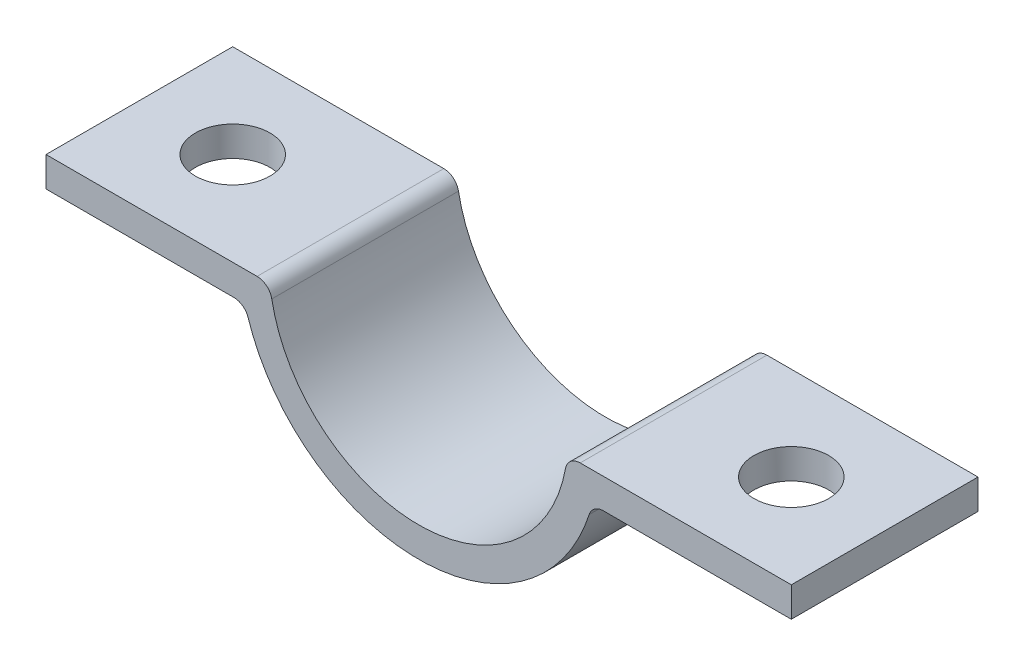
ISO-10303-21;
HEADER;
FILE_DESCRIPTION(('STEP AP214'),'2;1');
FILE_NAME('part.step','',(''),(''),'','','');
FILE_SCHEMA(('AUTOMOTIVE_DESIGN { 1 0 10303 214 1 1 1 1 }'));
ENDSEC;
DATA;
#1=APPLICATION_CONTEXT('core data for automotive mechanical design processes');
#2=APPLICATION_PROTOCOL_DEFINITION('international standard','automotive_design',2000,#1);
#3=PRODUCT_CONTEXT('',#1,'mechanical');
#4=PRODUCT('Part','Part','',(#3));
#5=PRODUCT_RELATED_PRODUCT_CATEGORY('part','',(#4));
#6=PRODUCT_DEFINITION_FORMATION('','',#4);
#7=PRODUCT_DEFINITION_CONTEXT('part definition',#1,'design');
#8=PRODUCT_DEFINITION('design','',#6,#7);
#9=PRODUCT_DEFINITION_SHAPE('','',#8);
#10=(LENGTH_UNIT() NAMED_UNIT(*) SI_UNIT(.MILLI.,.METRE.));
#11=(NAMED_UNIT(*) PLANE_ANGLE_UNIT() SI_UNIT($,.RADIAN.));
#12=(NAMED_UNIT(*) SI_UNIT($,.STERADIAN.) SOLID_ANGLE_UNIT());
#13=UNCERTAINTY_MEASURE_WITH_UNIT(LENGTH_MEASURE(1.E-05),#10,'distance_accuracy_value','');
#14=(GEOMETRIC_REPRESENTATION_CONTEXT(3) GLOBAL_UNCERTAINTY_ASSIGNED_CONTEXT((#13)) GLOBAL_UNIT_ASSIGNED_CONTEXT((#10,
#11,#12)) REPRESENTATION_CONTEXT('',''));
#15=CARTESIAN_POINT('',(0.,0.,0.));
#16=DIRECTION('',(0.,0.,1.));
#17=DIRECTION('',(1.,0.,0.));
#18=AXIS2_PLACEMENT_3D('',#15,#16,#17);
#19=CARTESIAN_POINT('',(24.9498743710662,19.0173195198486,12.5));
#20=DIRECTION('',(-1.,0.,0.));
#21=DIRECTION('',(0.,0.,1.));
#22=AXIS2_PLACEMENT_3D('',#19,#20,#21);
#23=PLANE('',#22);
#24=DIRECTION('',(0.,1.,0.));
#25=VECTOR('',#24,1.);
#26=CARTESIAN_POINT('',(24.9498743710662,19.0173195198486,0.));
#27=LINE('',#26,#25);
#28=CARTESIAN_POINT('',(24.9498743710662,17.0173195198486,0.));
#29=VERTEX_POINT('',#28);
#30=CARTESIAN_POINT('',(24.9498743710662,19.0173195198486,0.));
#31=VERTEX_POINT('',#30);
#32=EDGE_CURVE('E161',#29,#31,#27,.T.);
#33=ORIENTED_EDGE('',*,*,#32,.T.);
#34=DIRECTION('',(0.,0.,-1.));
#35=VECTOR('',#34,1.);
#36=CARTESIAN_POINT('',(24.9498743710662,19.0173195198486,12.5));
#37=LINE('',#36,#35);
#38=CARTESIAN_POINT('',(24.9498743710662,19.0173195198486,12.5));
#39=VERTEX_POINT('',#38);
#40=EDGE_CURVE('E45',#39,#31,#37,.T.);
#41=ORIENTED_EDGE('',*,*,#40,.F.);
#42=DIRECTION('',(0.,1.,0.));
#43=VECTOR('',#42,1.);
#44=CARTESIAN_POINT('',(24.9498743710662,19.0173195198486,12.5));
#45=LINE('',#44,#43);
#46=CARTESIAN_POINT('',(24.9498743710662,17.0173195198486,12.5));
#47=VERTEX_POINT('',#46);
#48=EDGE_CURVE('E109',#47,#39,#45,.T.);
#49=ORIENTED_EDGE('',*,*,#48,.F.);
#50=DIRECTION('',(0.,0.,-1.));
#51=VECTOR('',#50,1.);
#52=CARTESIAN_POINT('',(24.9498743710662,17.0173195198486,12.5));
#53=LINE('',#52,#51);
#54=EDGE_CURVE('E11',#47,#29,#53,.T.);
#55=ORIENTED_EDGE('',*,*,#54,.T.);
#56=EDGE_LOOP('',(#33,#41,#49,#55));
#57=FACE_BOUND('',#56,.T.);
#58=ADVANCED_FACE('F37',(#57),#23,.F.);
#59=CARTESIAN_POINT('',(10.816653826392,19.0173195198486,12.5));
#60=DIRECTION('',(0.,-1.,0.));
#61=DIRECTION('',(0.,0.,-1.));
#62=AXIS2_PLACEMENT_3D('',#59,#60,#61);
#63=PLANE('',#62);
#64=CARTESIAN_POINT('',(18.6998743710661,19.0173195198487,6.25));
#65=DIRECTION('',(0.,1.,0.));
#66=DIRECTION('',(0.,0.,-1.));
#67=AXIS2_PLACEMENT_3D('',#64,#65,#66);
#68=CIRCLE('',#67,2.5);
#69=CARTESIAN_POINT('',(18.6998743710661,19.0173195198487,3.74999999999999));
#70=VERTEX_POINT('',#69);
#71=EDGE_CURVE('E395',#70,#70,#68,.T.);
#72=ORIENTED_EDGE('',*,*,#71,.F.);
#73=EDGE_LOOP('',(#72));
#74=FACE_BOUND('',#73,.T.);
#75=DIRECTION('',(-1.,0.,0.));
#76=VECTOR('',#75,1.);
#77=CARTESIAN_POINT('',(10.816653826392,19.0173195198486,0.));
#78=LINE('',#77,#76);
#79=CARTESIAN_POINT('',(10.816653826392,19.0173195198486,0.));
#80=VERTEX_POINT('',#79);
#81=EDGE_CURVE('E164',#31,#80,#78,.T.);
#82=ORIENTED_EDGE('',*,*,#81,.T.);
#83=DIRECTION('',(0.,0.,-1.));
#84=VECTOR('',#83,1.);
#85=CARTESIAN_POINT('',(10.816653826392,19.0173195198486,12.5));
#86=LINE('',#85,#84);
#87=CARTESIAN_POINT('',(10.816653826392,19.0173195198486,12.5));
#88=VERTEX_POINT('',#87);
#89=EDGE_CURVE('E204',#88,#80,#86,.T.);
#90=ORIENTED_EDGE('',*,*,#89,.F.);
#91=DIRECTION('',(-1.,0.,0.));
#92=VECTOR('',#91,1.);
#93=CARTESIAN_POINT('',(19.9498743710662,19.0173195198486,12.5));
#94=LINE('',#93,#92);
#95=EDGE_CURVE('E211',#39,#88,#94,.T.);
#96=ORIENTED_EDGE('',*,*,#95,.F.);
#97=ORIENTED_EDGE('',*,*,#40,.T.);
#98=EDGE_LOOP('',(#82,#90,#96,#97));
#99=FACE_BOUND('',#98,.T.);
#100=ADVANCED_FACE('F209',(#74,#99),#63,.F.);
#101=CARTESIAN_POINT('',(10.816653826392,18.0173195198486,12.5));
#102=DIRECTION('',(0.,0.,-1.));
#103=DIRECTION('',(-1.,0.,0.));
#104=AXIS2_PLACEMENT_3D('',#101,#102,#103);
#105=CYLINDRICAL_SURFACE('',#104,1.);
#106=CARTESIAN_POINT('',(10.816653826392,18.0173195198486,0.));
#107=DIRECTION('',(0.,0.,1.));
#108=DIRECTION('',(1.,0.,0.));
#109=AXIS2_PLACEMENT_3D('',#106,#107,#108);
#110=CIRCLE('',#109,1.);
#111=CARTESIAN_POINT('',(9.83332166035634,18.1991377016668,0.));
#112=VERTEX_POINT('',#111);
#113=EDGE_CURVE('E167',#80,#112,#110,.T.);
#114=ORIENTED_EDGE('',*,*,#113,.T.);
#115=DIRECTION('',(0.,0.,-1.));
#116=VECTOR('',#115,1.);
#117=CARTESIAN_POINT('',(9.83332166035634,18.1991377016668,12.5));
#118=LINE('',#117,#116);
#119=CARTESIAN_POINT('',(9.83332166035634,18.1991377016668,12.5));
#120=VERTEX_POINT('',#119);
#121=EDGE_CURVE('E201',#120,#112,#118,.T.);
#122=ORIENTED_EDGE('',*,*,#121,.F.);
#123=CARTESIAN_POINT('',(10.816653826392,18.0173195198486,12.5));
#124=DIRECTION('',(0.,0.,1.));
#125=DIRECTION('',(1.,0.,0.));
#126=AXIS2_PLACEMENT_3D('',#123,#124,#125);
#127=CIRCLE('',#126,1.);
#128=EDGE_CURVE('E230',#88,#120,#127,.T.);
#129=ORIENTED_EDGE('',*,*,#128,.F.);
#130=ORIENTED_EDGE('',*,*,#89,.T.);
#131=EDGE_LOOP('',(#114,#122,#129,#130));
#132=FACE_BOUND('',#131,.T.);
#133=ADVANCED_FACE('F221',(#132),#105,.T.);
#134=CARTESIAN_POINT('',(0.,20.0173195198486,12.5));
#135=DIRECTION('',(0.,0.,-1.));
#136=DIRECTION('',(-1.,0.,0.));
#137=AXIS2_PLACEMENT_3D('',#134,#135,#136);
#138=CYLINDRICAL_SURFACE('',#137,10.);
#139=CARTESIAN_POINT('',(0.,20.0173195198486,0.));
#140=DIRECTION('',(0.,0.,-1.));
#141=DIRECTION('',(1.,0.,0.));
#142=AXIS2_PLACEMENT_3D('',#139,#140,#141);
#143=CIRCLE('',#142,10.);
#144=CARTESIAN_POINT('',(-9.83332166035634,18.1991377016668,0.));
#145=VERTEX_POINT('',#144);
#146=EDGE_CURVE('E169',#112,#145,#143,.T.);
#147=ORIENTED_EDGE('',*,*,#146,.T.);
#148=DIRECTION('',(0.,0.,-1.));
#149=VECTOR('',#148,1.);
#150=CARTESIAN_POINT('',(-9.83332166035634,18.1991377016668,12.5));
#151=LINE('',#150,#149);
#152=CARTESIAN_POINT('',(-9.83332166035634,18.1991377016668,12.5));
#153=VERTEX_POINT('',#152);
#154=EDGE_CURVE('E198',#153,#145,#151,.T.);
#155=ORIENTED_EDGE('',*,*,#154,.F.);
#156=CARTESIAN_POINT('',(0.,20.0173195198486,12.5));
#157=DIRECTION('',(0.,0.,-1.));
#158=DIRECTION('',(1.,0.,0.));
#159=AXIS2_PLACEMENT_3D('',#156,#157,#158);
#160=CIRCLE('',#159,10.);
#161=EDGE_CURVE('E227',#120,#153,#160,.T.);
#162=ORIENTED_EDGE('',*,*,#161,.F.);
#163=ORIENTED_EDGE('',*,*,#121,.T.);
#164=EDGE_LOOP('',(#147,#155,#162,#163));
#165=FACE_BOUND('',#164,.T.);
#166=ADVANCED_FACE('F225',(#165),#138,.F.);
#167=CARTESIAN_POINT('',(-10.816653826392,18.0173195198486,12.5));
#168=DIRECTION('',(0.,0.,-1.));
#169=DIRECTION('',(-1.,0.,0.));
#170=AXIS2_PLACEMENT_3D('',#167,#168,#169);
#171=CYLINDRICAL_SURFACE('',#170,1.);
#172=CARTESIAN_POINT('',(-10.816653826392,18.0173195198486,0.));
#173=DIRECTION('',(0.,0.,1.));
#174=DIRECTION('',(-1.,0.,0.));
#175=AXIS2_PLACEMENT_3D('',#172,#173,#174);
#176=CIRCLE('',#175,1.);
#177=CARTESIAN_POINT('',(-10.816653826392,19.0173195198486,0.));
#178=VERTEX_POINT('',#177);
#179=EDGE_CURVE('E171',#145,#178,#176,.T.);
#180=ORIENTED_EDGE('',*,*,#179,.T.);
#181=DIRECTION('',(0.,0.,-1.));
#182=VECTOR('',#181,1.);
#183=CARTESIAN_POINT('',(-10.816653826392,19.0173195198486,12.5));
#184=LINE('',#183,#182);
#185=CARTESIAN_POINT('',(-10.816653826392,19.0173195198486,12.5));
#186=VERTEX_POINT('',#185);
#187=EDGE_CURVE('E195',#186,#178,#184,.T.);
#188=ORIENTED_EDGE('',*,*,#187,.F.);
#189=CARTESIAN_POINT('',(-10.816653826392,18.0173195198486,12.5));
#190=DIRECTION('',(0.,0.,1.));
#191=DIRECTION('',(-1.,0.,0.));
#192=AXIS2_PLACEMENT_3D('',#189,#190,#191);
#193=CIRCLE('',#192,1.);
#194=EDGE_CURVE('E229',#153,#186,#193,.T.);
#195=ORIENTED_EDGE('',*,*,#194,.F.);
#196=ORIENTED_EDGE('',*,*,#154,.T.);
#197=EDGE_LOOP('',(#180,#188,#195,#196));
#198=FACE_BOUND('',#197,.T.);
#199=ADVANCED_FACE('F251',(#198),#171,.T.);
#200=CARTESIAN_POINT('',(-19.9498743710662,19.0173195198486,12.5));
#201=DIRECTION('',(0.,-1.,0.));
#202=DIRECTION('',(1.,0.,0.));
#203=AXIS2_PLACEMENT_3D('',#200,#201,#202);
#204=PLANE('',#203);
#205=CARTESIAN_POINT('',(-18.6998743710662,19.0173195198487,6.25));
#206=DIRECTION('',(0.,1.,0.));
#207=DIRECTION('',(0.,0.,1.));
#208=AXIS2_PLACEMENT_3D('',#205,#206,#207);
#209=CIRCLE('',#208,2.5);
#210=CARTESIAN_POINT('',(-18.6998743710662,19.0173195198487,8.75));
#211=VERTEX_POINT('',#210);
#212=EDGE_CURVE('E388',#211,#211,#209,.T.);
#213=ORIENTED_EDGE('',*,*,#212,.F.);
#214=EDGE_LOOP('',(#213));
#215=FACE_BOUND('',#214,.T.);
#216=DIRECTION('',(-1.,0.,0.));
#217=VECTOR('',#216,1.);
#218=CARTESIAN_POINT('',(-19.9498743710662,19.0173195198486,0.));
#219=LINE('',#218,#217);
#220=CARTESIAN_POINT('',(-24.9498743710662,19.0173195198486,0.));
#221=VERTEX_POINT('',#220);
#222=EDGE_CURVE('E174',#178,#221,#219,.T.);
#223=ORIENTED_EDGE('',*,*,#222,.T.);
#224=DIRECTION('',(0.,0.,-1.));
#225=VECTOR('',#224,1.);
#226=CARTESIAN_POINT('',(-24.9498743710662,19.0173195198486,12.5));
#227=LINE('',#226,#225);
#228=CARTESIAN_POINT('',(-24.9498743710662,19.0173195198486,12.5));
#229=VERTEX_POINT('',#228);
#230=EDGE_CURVE('E192',#229,#221,#227,.T.);
#231=ORIENTED_EDGE('',*,*,#230,.F.);
#232=DIRECTION('',(-1.,0.,0.));
#233=VECTOR('',#232,1.);
#234=CARTESIAN_POINT('',(-10.816653826392,19.0173195198486,12.5));
#235=LINE('',#234,#233);
#236=EDGE_CURVE('E232',#186,#229,#235,.T.);
#237=ORIENTED_EDGE('',*,*,#236,.F.);
#238=ORIENTED_EDGE('',*,*,#187,.T.);
#239=EDGE_LOOP('',(#223,#231,#237,#238));
#240=FACE_BOUND('',#239,.T.);
#241=ADVANCED_FACE('F252',(#215,#240),#204,.F.);
#242=CARTESIAN_POINT('',(-24.9498743710662,19.0173195198486,12.5));
#243=DIRECTION('',(1.,0.,0.));
#244=DIRECTION('',(0.,0.,-1.));
#245=AXIS2_PLACEMENT_3D('',#242,#243,#244);
#246=PLANE('',#245);
#247=DIRECTION('',(0.,-1.,0.));
#248=VECTOR('',#247,1.);
#249=CARTESIAN_POINT('',(-24.9498743710662,19.0173195198486,0.));
#250=LINE('',#249,#248);
#251=CARTESIAN_POINT('',(-24.9498743710662,17.0173195198486,0.));
#252=VERTEX_POINT('',#251);
#253=EDGE_CURVE('E176',#221,#252,#250,.T.);
#254=ORIENTED_EDGE('',*,*,#253,.T.);
#255=DIRECTION('',(0.,0.,-1.));
#256=VECTOR('',#255,1.);
#257=CARTESIAN_POINT('',(-24.9498743710662,17.0173195198486,12.5));
#258=LINE('',#257,#256);
#259=CARTESIAN_POINT('',(-24.9498743710662,17.0173195198486,12.5));
#260=VERTEX_POINT('',#259);
#261=EDGE_CURVE('E189',#260,#252,#258,.T.);
#262=ORIENTED_EDGE('',*,*,#261,.F.);
#263=DIRECTION('',(0.,-1.,0.));
#264=VECTOR('',#263,1.);
#265=CARTESIAN_POINT('',(-24.9498743710662,19.0173195198486,12.5));
#266=LINE('',#265,#264);
#267=EDGE_CURVE('E238',#229,#260,#266,.T.);
#268=ORIENTED_EDGE('',*,*,#267,.F.);
#269=ORIENTED_EDGE('',*,*,#230,.T.);
#270=EDGE_LOOP('',(#254,#262,#268,#269));
#271=FACE_BOUND('',#270,.T.);
#272=ADVANCED_FACE('F244',(#271),#246,.F.);
#273=CARTESIAN_POINT('',(-19.9498743710662,17.0173195198486,12.5));
#274=DIRECTION('',(0.,1.,0.));
#275=DIRECTION('',(0.,0.,1.));
#276=AXIS2_PLACEMENT_3D('',#273,#274,#275);
#277=PLANE('',#276);
#278=CARTESIAN_POINT('',(-18.6998743710662,17.0173195198486,6.25));
#279=DIRECTION('',(0.,1.,0.));
#280=DIRECTION('',(0.,0.,1.));
#281=AXIS2_PLACEMENT_3D('',#278,#279,#280);
#282=CIRCLE('',#281,2.5);
#283=CARTESIAN_POINT('',(-18.6998743710662,17.0173195198486,8.75));
#284=VERTEX_POINT('',#283);
#285=EDGE_CURVE('E165',#284,#284,#282,.F.);
#286=ORIENTED_EDGE('',*,*,#285,.F.);
#287=EDGE_LOOP('',(#286));
#288=FACE_BOUND('',#287,.T.);
#289=DIRECTION('',(1.,0.,0.));
#290=VECTOR('',#289,1.);
#291=CARTESIAN_POINT('',(-19.9498743710662,17.0173195198486,0.));
#292=LINE('',#291,#290);
#293=CARTESIAN_POINT('',(-12.369316876853,17.0173195198486,0.));
#294=VERTEX_POINT('',#293);
#295=EDGE_CURVE('E179',#252,#294,#292,.T.);
#296=ORIENTED_EDGE('',*,*,#295,.T.);
#297=DIRECTION('',(0.,0.,-1.));
#298=VECTOR('',#297,1.);
#299=CARTESIAN_POINT('',(-12.369316876853,17.0173195198486,12.5));
#300=LINE('',#299,#298);
#301=CARTESIAN_POINT('',(-12.369316876853,17.0173195198486,12.5));
#302=VERTEX_POINT('',#301);
#303=EDGE_CURVE('E150',#302,#294,#300,.T.);
#304=ORIENTED_EDGE('',*,*,#303,.F.);
#305=DIRECTION('',(1.,0.,0.));
#306=VECTOR('',#305,1.);
#307=CARTESIAN_POINT('',(-24.9498743710662,17.0173195198486,12.5));
#308=LINE('',#307,#306);
#309=EDGE_CURVE('E141',#260,#302,#308,.T.);
#310=ORIENTED_EDGE('',*,*,#309,.F.);
#311=ORIENTED_EDGE('',*,*,#261,.T.);
#312=EDGE_LOOP('',(#296,#304,#310,#311));
#313=FACE_BOUND('',#312,.T.);
#314=ADVANCED_FACE('F247',(#288,#313),#277,.F.);
#315=CARTESIAN_POINT('',(-12.369316876853,16.0173195198486,12.5));
#316=DIRECTION('',(0.,0.,-1.));
#317=DIRECTION('',(-1.,0.,0.));
#318=AXIS2_PLACEMENT_3D('',#315,#316,#317);
#319=CYLINDRICAL_SURFACE('',#318,1.);
#320=CARTESIAN_POINT('',(-12.369316876853,16.0173195198486,0.));
#321=DIRECTION('',(0.,0.,-1.));
#322=DIRECTION('',(-1.,0.,0.));
#323=AXIS2_PLACEMENT_3D('',#320,#321,#322);
#324=CIRCLE('',#323,1.);
#325=CARTESIAN_POINT('',(-11.4178309632489,16.3250118275409,0.));
#326=VERTEX_POINT('',#325);
#327=EDGE_CURVE('E149',#294,#326,#324,.T.);
#328=ORIENTED_EDGE('',*,*,#327,.T.);
#329=DIRECTION('',(0.,0.,-1.));
#330=VECTOR('',#329,1.);
#331=CARTESIAN_POINT('',(-11.4178309632489,16.3250118275409,12.5));
#332=LINE('',#331,#330);
#333=CARTESIAN_POINT('',(-11.4178309632489,16.3250118275409,12.5));
#334=VERTEX_POINT('',#333);
#335=EDGE_CURVE('E146',#334,#326,#332,.T.);
#336=ORIENTED_EDGE('',*,*,#335,.F.);
#337=CARTESIAN_POINT('',(-12.369316876853,16.0173195198486,12.5));
#338=DIRECTION('',(0.,0.,-1.));
#339=DIRECTION('',(-1.,0.,0.));
#340=AXIS2_PLACEMENT_3D('',#337,#338,#339);
#341=CIRCLE('',#340,1.);
#342=EDGE_CURVE('E135',#302,#334,#341,.T.);
#343=ORIENTED_EDGE('',*,*,#342,.F.);
#344=ORIENTED_EDGE('',*,*,#303,.T.);
#345=EDGE_LOOP('',(#328,#336,#343,#344));
#346=FACE_BOUND('',#345,.T.);
#347=ADVANCED_FACE('F147',(#346),#319,.F.);
#348=CARTESIAN_POINT('',(0.,20.0173195198486,12.5));
#349=DIRECTION('',(0.,0.,-1.));
#350=DIRECTION('',(-1.,0.,0.));
#351=AXIS2_PLACEMENT_3D('',#348,#349,#350);
#352=CYLINDRICAL_SURFACE('',#351,12.);
#353=CARTESIAN_POINT('',(0.,20.0173195198486,0.));
#354=DIRECTION('',(0.,0.,1.));
#355=DIRECTION('',(1.,0.,0.));
#356=AXIS2_PLACEMENT_3D('',#353,#354,#355);
#357=CIRCLE('',#356,12.);
#358=CARTESIAN_POINT('',(11.4178309632489,16.3250118275409,0.));
#359=VERTEX_POINT('',#358);
#360=EDGE_CURVE('E95',#326,#359,#357,.T.);
#361=ORIENTED_EDGE('',*,*,#360,.T.);
#362=DIRECTION('',(0.,0.,-1.));
#363=VECTOR('',#362,1.);
#364=CARTESIAN_POINT('',(11.4178309632489,16.3250118275409,12.5));
#365=LINE('',#364,#363);
#366=CARTESIAN_POINT('',(11.4178309632489,16.3250118275409,12.5));
#367=VERTEX_POINT('',#366);
#368=EDGE_CURVE('E151',#367,#359,#365,.T.);
#369=ORIENTED_EDGE('',*,*,#368,.F.);
#370=CARTESIAN_POINT('',(0.,20.0173195198486,12.5));
#371=DIRECTION('',(0.,0.,1.));
#372=DIRECTION('',(1.,0.,0.));
#373=AXIS2_PLACEMENT_3D('',#370,#371,#372);
#374=CIRCLE('',#373,12.);
#375=EDGE_CURVE('E139',#334,#367,#374,.T.);
#376=ORIENTED_EDGE('',*,*,#375,.F.);
#377=ORIENTED_EDGE('',*,*,#335,.T.);
#378=EDGE_LOOP('',(#361,#369,#376,#377));
#379=FACE_BOUND('',#378,.T.);
#380=ADVANCED_FACE('F153',(#379),#352,.T.);
#381=CARTESIAN_POINT('',(12.369316876853,16.0173195198486,12.5));
#382=DIRECTION('',(0.,0.,-1.));
#383=DIRECTION('',(-1.,0.,0.));
#384=AXIS2_PLACEMENT_3D('',#381,#382,#383);
#385=CYLINDRICAL_SURFACE('',#384,1.);
#386=CARTESIAN_POINT('',(12.369316876853,16.0173195198486,0.));
#387=DIRECTION('',(0.,0.,-1.));
#388=DIRECTION('',(1.,0.,0.));
#389=AXIS2_PLACEMENT_3D('',#386,#387,#388);
#390=CIRCLE('',#389,1.);
#391=CARTESIAN_POINT('',(12.369316876853,17.0173195198486,0.));
#392=VERTEX_POINT('',#391);
#393=EDGE_CURVE('E102',#359,#392,#390,.T.);
#394=ORIENTED_EDGE('',*,*,#393,.T.);
#395=DIRECTION('',(0.,0.,-1.));
#396=VECTOR('',#395,1.);
#397=CARTESIAN_POINT('',(12.369316876853,17.0173195198486,12.5));
#398=LINE('',#397,#396);
#399=CARTESIAN_POINT('',(12.369316876853,17.0173195198486,12.5));
#400=VERTEX_POINT('',#399);
#401=EDGE_CURVE('E157',#400,#392,#398,.T.);
#402=ORIENTED_EDGE('',*,*,#401,.F.);
#403=CARTESIAN_POINT('',(12.369316876853,16.0173195198486,12.5));
#404=DIRECTION('',(0.,0.,-1.));
#405=DIRECTION('',(1.,0.,0.));
#406=AXIS2_PLACEMENT_3D('',#403,#404,#405);
#407=CIRCLE('',#406,1.);
#408=EDGE_CURVE('E155',#367,#400,#407,.T.);
#409=ORIENTED_EDGE('',*,*,#408,.F.);
#410=ORIENTED_EDGE('',*,*,#368,.T.);
#411=EDGE_LOOP('',(#394,#402,#409,#410));
#412=FACE_BOUND('',#411,.T.);
#413=ADVANCED_FACE('F311',(#412),#385,.F.);
#414=CARTESIAN_POINT('',(19.9498743710662,17.0173195198486,12.5));
#415=DIRECTION('',(0.,1.,0.));
#416=DIRECTION('',(0.,0.,1.));
#417=AXIS2_PLACEMENT_3D('',#414,#415,#416);
#418=PLANE('',#417);
#419=CARTESIAN_POINT('',(18.6998743710661,17.0173195198486,6.25));
#420=DIRECTION('',(0.,1.,0.));
#421=DIRECTION('',(0.,0.,1.));
#422=AXIS2_PLACEMENT_3D('',#419,#420,#421);
#423=CIRCLE('',#422,2.5);
#424=CARTESIAN_POINT('',(18.6998743710661,17.0173195198486,8.75));
#425=VERTEX_POINT('',#424);
#426=EDGE_CURVE('E392',#425,#425,#423,.F.);
#427=ORIENTED_EDGE('',*,*,#426,.F.);
#428=EDGE_LOOP('',(#427));
#429=FACE_BOUND('',#428,.T.);
#430=DIRECTION('',(1.,0.,0.));
#431=VECTOR('',#430,1.);
#432=CARTESIAN_POINT('',(19.9498743710662,17.0173195198486,0.));
#433=LINE('',#432,#431);
#434=EDGE_CURVE('E184',#392,#29,#433,.T.);
#435=ORIENTED_EDGE('',*,*,#434,.T.);
#436=ORIENTED_EDGE('',*,*,#54,.F.);
#437=DIRECTION('',(1.,0.,0.));
#438=VECTOR('',#437,1.);
#439=CARTESIAN_POINT('',(24.9498743710662,17.0173195198486,12.5));
#440=LINE('',#439,#438);
#441=EDGE_CURVE('E53',#400,#47,#440,.T.);
#442=ORIENTED_EDGE('',*,*,#441,.F.);
#443=ORIENTED_EDGE('',*,*,#401,.T.);
#444=EDGE_LOOP('',(#435,#436,#442,#443));
#445=FACE_BOUND('',#444,.T.);
#446=ADVANCED_FACE('F320',(#429,#445),#418,.F.);
#447=CARTESIAN_POINT('',(12.369316876853,16.0173195198486,12.5));
#448=DIRECTION('',(0.,0.,1.));
#449=DIRECTION('',(1.,0.,0.));
#450=AXIS2_PLACEMENT_3D('',#447,#448,#449);
#451=PLANE('',#450);
#452=ORIENTED_EDGE('',*,*,#441,.T.);
#453=ORIENTED_EDGE('',*,*,#48,.T.);
#454=ORIENTED_EDGE('',*,*,#95,.T.);
#455=ORIENTED_EDGE('',*,*,#128,.T.);
#456=ORIENTED_EDGE('',*,*,#161,.T.);
#457=ORIENTED_EDGE('',*,*,#194,.T.);
#458=ORIENTED_EDGE('',*,*,#236,.T.);
#459=ORIENTED_EDGE('',*,*,#267,.T.);
#460=ORIENTED_EDGE('',*,*,#309,.T.);
#461=ORIENTED_EDGE('',*,*,#342,.T.);
#462=ORIENTED_EDGE('',*,*,#375,.T.);
#463=ORIENTED_EDGE('',*,*,#408,.T.);
#464=EDGE_LOOP('',(#452,#453,#454,#455,#456,#457,#458,#459,#460,#461,#462,#463));
#465=FACE_BOUND('',#464,.T.);
#466=ADVANCED_FACE('F137',(#465),#451,.T.);
#467=CARTESIAN_POINT('',(12.369316876853,16.0173195198486,0.));
#468=DIRECTION('',(0.,0.,1.));
#469=DIRECTION('',(1.,0.,0.));
#470=AXIS2_PLACEMENT_3D('',#467,#468,#469);
#471=PLANE('',#470);
#472=ORIENTED_EDGE('',*,*,#32,.F.);
#473=ORIENTED_EDGE('',*,*,#434,.F.);
#474=ORIENTED_EDGE('',*,*,#393,.F.);
#475=ORIENTED_EDGE('',*,*,#360,.F.);
#476=ORIENTED_EDGE('',*,*,#327,.F.);
#477=ORIENTED_EDGE('',*,*,#295,.F.);
#478=ORIENTED_EDGE('',*,*,#253,.F.);
#479=ORIENTED_EDGE('',*,*,#222,.F.);
#480=ORIENTED_EDGE('',*,*,#179,.F.);
#481=ORIENTED_EDGE('',*,*,#146,.F.);
#482=ORIENTED_EDGE('',*,*,#113,.F.);
#483=ORIENTED_EDGE('',*,*,#81,.F.);
#484=EDGE_LOOP('',(#472,#473,#474,#475,#476,#477,#478,#479,#480,#481,#482,#483));
#485=FACE_BOUND('',#484,.T.);
#486=ADVANCED_FACE('F215',(#485),#471,.F.);
#487=CARTESIAN_POINT('',(18.6998743710661,8.01631951984864,6.25));
#488=DIRECTION('',(0.,1.,0.));
#489=DIRECTION('',(0.,0.,1.));
#490=AXIS2_PLACEMENT_3D('',#487,#488,#489);
#491=CYLINDRICAL_SURFACE('',#490,2.5);
#492=ORIENTED_EDGE('',*,*,#71,.T.);
#493=EDGE_LOOP('',(#492));
#494=FACE_BOUND('',#493,.T.);
#495=ORIENTED_EDGE('',*,*,#426,.T.);
#496=EDGE_LOOP('',(#495));
#497=FACE_BOUND('',#496,.T.);
#498=ADVANCED_FACE('F339',(#494,#497),#491,.F.);
#499=CARTESIAN_POINT('',(-18.6998743710662,8.01631951984864,6.25));
#500=DIRECTION('',(0.,1.,0.));
#501=DIRECTION('',(0.,0.,1.));
#502=AXIS2_PLACEMENT_3D('',#499,#500,#501);
#503=CYLINDRICAL_SURFACE('',#502,2.5);
#504=ORIENTED_EDGE('',*,*,#212,.T.);
#505=EDGE_LOOP('',(#504));
#506=FACE_BOUND('',#505,.T.);
#507=ORIENTED_EDGE('',*,*,#285,.T.);
#508=EDGE_LOOP('',(#507));
#509=FACE_BOUND('',#508,.T.);
#510=ADVANCED_FACE('F372',(#506,#509),#503,.F.);
#511=CLOSED_SHELL('',(#58,#100,#133,#166,#199,#241,#272,#314,#347,#380,#413,#446,#466,#486,#498,#510));
#512=MANIFOLD_SOLID_BREP('B2',#511);
#513=ADVANCED_BREP_SHAPE_REPRESENTATION('',(#18,#512),#14);
#514=SHAPE_DEFINITION_REPRESENTATION(#9,#513);
ENDSEC;
END-ISO-10303-21;
